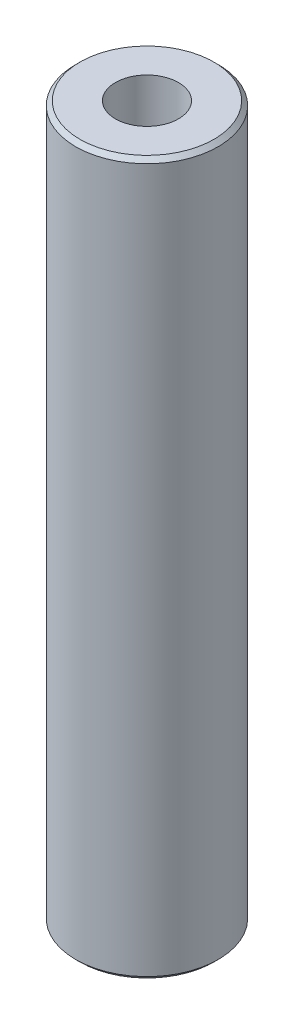
ISO-10303-21;
HEADER;
FILE_DESCRIPTION(('STEP AP214'),'2;1');
FILE_NAME('part.step','',(''),(''),'','','');
FILE_SCHEMA(('AUTOMOTIVE_DESIGN { 1 0 10303 214 1 1 1 1 }'));
ENDSEC;
DATA;
#1=APPLICATION_CONTEXT('core data for automotive mechanical design processes');
#2=APPLICATION_PROTOCOL_DEFINITION('international standard','automotive_design',2000,#1);
#3=PRODUCT_CONTEXT('',#1,'mechanical');
#4=PRODUCT('Part','Part','',(#3));
#5=PRODUCT_RELATED_PRODUCT_CATEGORY('part','',(#4));
#6=PRODUCT_DEFINITION_FORMATION('','',#4);
#7=PRODUCT_DEFINITION_CONTEXT('part definition',#1,'design');
#8=PRODUCT_DEFINITION('design','',#6,#7);
#9=PRODUCT_DEFINITION_SHAPE('','',#8);
#10=(LENGTH_UNIT() NAMED_UNIT(*) SI_UNIT(.MILLI.,.METRE.));
#11=(NAMED_UNIT(*) PLANE_ANGLE_UNIT() SI_UNIT($,.RADIAN.));
#12=(NAMED_UNIT(*) SI_UNIT($,.STERADIAN.) SOLID_ANGLE_UNIT());
#13=UNCERTAINTY_MEASURE_WITH_UNIT(LENGTH_MEASURE(1.E-05),#10,'distance_accuracy_value','');
#14=(GEOMETRIC_REPRESENTATION_CONTEXT(3) GLOBAL_UNCERTAINTY_ASSIGNED_CONTEXT((#13)) GLOBAL_UNIT_ASSIGNED_CONTEXT((#10,
#11,#12)) REPRESENTATION_CONTEXT('',''));
#15=CARTESIAN_POINT('',(0.,0.,0.));
#16=DIRECTION('',(0.,0.,1.));
#17=DIRECTION('',(1.,0.,0.));
#18=AXIS2_PLACEMENT_3D('',#15,#16,#17);
#19=CARTESIAN_POINT('',(0.,600.,0.));
#20=DIRECTION('',(0.,-1.,0.));
#21=DIRECTION('',(0.,0.,-1.));
#22=AXIS2_PLACEMENT_3D('',#19,#20,#21);
#23=CYLINDRICAL_SURFACE('',#22,60.);
#24=CARTESIAN_POINT('',(0.,596.413386056115,0.));
#25=DIRECTION('',(0.,1.,0.));
#26=DIRECTION('',(0.,0.,1.));
#27=AXIS2_PLACEMENT_3D('',#24,#25,#26);
#28=CIRCLE('',#27,60.);
#29=CARTESIAN_POINT('',(0.,596.413386056115,60.));
#30=VERTEX_POINT('',#29);
#31=EDGE_CURVE('E50',#30,#30,#28,.F.);
#32=ORIENTED_EDGE('',*,*,#31,.T.);
#33=EDGE_LOOP('',(#32));
#34=FACE_BOUND('',#33,.T.);
#35=CARTESIAN_POINT('',(0.,3.58661394388493,0.));
#36=DIRECTION('',(0.,1.,0.));
#37=DIRECTION('',(0.,0.,1.));
#38=AXIS2_PLACEMENT_3D('',#35,#36,#37);
#39=CIRCLE('',#38,60.);
#40=CARTESIAN_POINT('',(0.,3.58661394388493,60.));
#41=VERTEX_POINT('',#40);
#42=EDGE_CURVE('E51',#41,#41,#39,.T.);
#43=ORIENTED_EDGE('',*,*,#42,.T.);
#44=EDGE_LOOP('',(#43));
#45=FACE_BOUND('',#44,.T.);
#46=ADVANCED_FACE('F39',(#34,#45),#23,.T.);
#47=CARTESIAN_POINT('',(0.,600.,0.));
#48=DIRECTION('',(0.,1.,0.));
#49=DIRECTION('',(0.,0.,1.));
#50=AXIS2_PLACEMENT_3D('',#47,#48,#49);
#51=PLANE('',#50);
#52=CARTESIAN_POINT('',(0.,600.,0.));
#53=DIRECTION('',(0.,1.,0.));
#54=DIRECTION('',(0.,0.,1.));
#55=AXIS2_PLACEMENT_3D('',#52,#53,#54);
#56=CIRCLE('',#55,56.4133860561151);
#57=CARTESIAN_POINT('',(0.,600.,56.4133860561151));
#58=VERTEX_POINT('',#57);
#59=EDGE_CURVE('E54',#58,#58,#56,.T.);
#60=ORIENTED_EDGE('',*,*,#59,.T.);
#61=EDGE_LOOP('',(#60));
#62=FACE_BOUND('',#61,.T.);
#63=CARTESIAN_POINT('',(0.,600.,0.));
#64=DIRECTION('',(0.,1.,0.));
#65=DIRECTION('',(0.,0.,1.));
#66=AXIS2_PLACEMENT_3D('',#63,#64,#65);
#67=CIRCLE('',#66,26.5549687277195);
#68=CARTESIAN_POINT('',(0.,600.,26.5549687277195));
#69=VERTEX_POINT('',#68);
#70=EDGE_CURVE('E58',#69,#69,#67,.T.);
#71=ORIENTED_EDGE('',*,*,#70,.F.);
#72=EDGE_LOOP('',(#71));
#73=FACE_BOUND('',#72,.T.);
#74=ADVANCED_FACE('F69',(#62,#73),#51,.T.);
#75=CARTESIAN_POINT('',(0.,0.,0.));
#76=DIRECTION('',(0.,1.,0.));
#77=DIRECTION('',(0.,0.,1.));
#78=AXIS2_PLACEMENT_3D('',#75,#76,#77);
#79=PLANE('',#78);
#80=CARTESIAN_POINT('',(0.,0.,0.));
#81=DIRECTION('',(0.,1.,0.));
#82=DIRECTION('',(0.,0.,1.));
#83=AXIS2_PLACEMENT_3D('',#80,#81,#82);
#84=CIRCLE('',#83,56.413386056115);
#85=CARTESIAN_POINT('',(0.,0.,56.413386056115));
#86=VERTEX_POINT('',#85);
#87=EDGE_CURVE('E10',#86,#86,#84,.F.);
#88=ORIENTED_EDGE('',*,*,#87,.T.);
#89=EDGE_LOOP('',(#88));
#90=FACE_BOUND('',#89,.T.);
#91=CARTESIAN_POINT('',(0.,0.,0.));
#92=DIRECTION('',(0.,1.,0.));
#93=DIRECTION('',(0.,0.,1.));
#94=AXIS2_PLACEMENT_3D('',#91,#92,#93);
#95=CIRCLE('',#94,26.5549687277195);
#96=CARTESIAN_POINT('',(0.,0.,26.5549687277195));
#97=VERTEX_POINT('',#96);
#98=EDGE_CURVE('E63',#97,#97,#95,.T.);
#99=ORIENTED_EDGE('',*,*,#98,.T.);
#100=EDGE_LOOP('',(#99));
#101=FACE_BOUND('',#100,.T.);
#102=ADVANCED_FACE('F75',(#90,#101),#79,.F.);
#103=CARTESIAN_POINT('',(0.,600.,0.));
#104=DIRECTION('',(0.,-1.,0.));
#105=DIRECTION('',(0.,0.,-1.));
#106=AXIS2_PLACEMENT_3D('',#103,#104,#105);
#107=CYLINDRICAL_SURFACE('',#106,26.5549687277195);
#108=ORIENTED_EDGE('',*,*,#70,.T.);
#109=EDGE_LOOP('',(#108));
#110=FACE_BOUND('',#109,.T.);
#111=ORIENTED_EDGE('',*,*,#98,.F.);
#112=EDGE_LOOP('',(#111));
#113=FACE_BOUND('',#112,.T.);
#114=ADVANCED_FACE('F70',(#110,#113),#107,.F.);
#115=CARTESIAN_POINT('',(0.,600.,0.));
#116=DIRECTION('',(0.,-1.,0.));
#117=DIRECTION('',(0.,0.,-1.));
#118=AXIS2_PLACEMENT_3D('',#115,#116,#117);
#119=CONICAL_SURFACE('',#118,56.4133860561151,0.785398163397433);
#120=ORIENTED_EDGE('',*,*,#31,.F.);
#121=EDGE_LOOP('',(#120));
#122=FACE_BOUND('',#121,.T.);
#123=ORIENTED_EDGE('',*,*,#59,.F.);
#124=EDGE_LOOP('',(#123));
#125=FACE_BOUND('',#124,.T.);
#126=ADVANCED_FACE('F81',(#122,#125),#119,.T.);
#127=CARTESIAN_POINT('',(0.,3.58661394388493,0.));
#128=DIRECTION('',(0.,1.,0.));
#129=DIRECTION('',(0.,0.,1.));
#130=AXIS2_PLACEMENT_3D('',#127,#128,#129);
#131=CONICAL_SURFACE('',#130,60.,0.785398163397456);
#132=ORIENTED_EDGE('',*,*,#87,.F.);
#133=EDGE_LOOP('',(#132));
#134=FACE_BOUND('',#133,.T.);
#135=ORIENTED_EDGE('',*,*,#42,.F.);
#136=EDGE_LOOP('',(#135));
#137=FACE_BOUND('',#136,.T.);
#138=ADVANCED_FACE('F45',(#134,#137),#131,.T.);
#139=CLOSED_SHELL('',(#46,#74,#102,#114,#126,#138));
#140=MANIFOLD_SOLID_BREP('B2',#139);
#141=ADVANCED_BREP_SHAPE_REPRESENTATION('',(#18,#140),#14);
#142=SHAPE_DEFINITION_REPRESENTATION(#9,#141);
ENDSEC;
END-ISO-10303-21;
